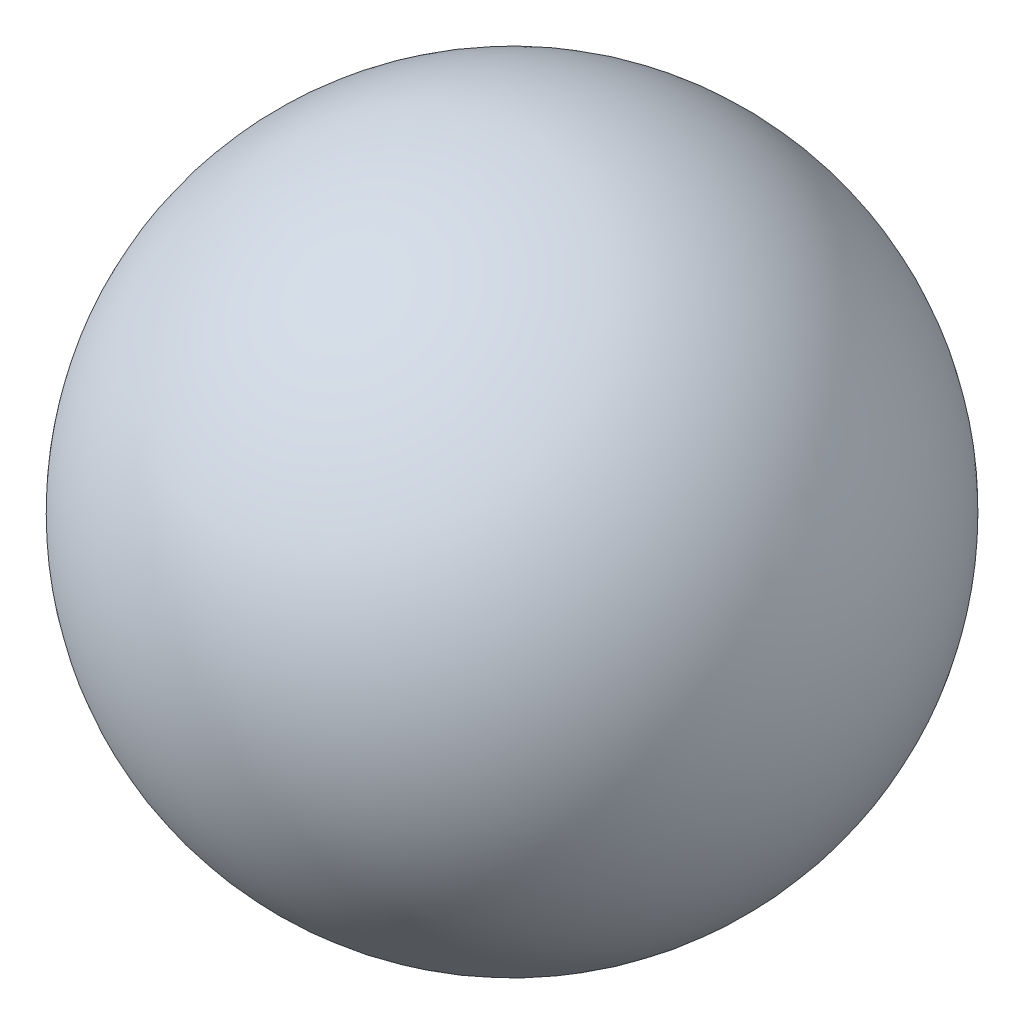
ISO-10303-21;
HEADER;
FILE_DESCRIPTION(('STEP AP214'),'2;1');
FILE_NAME('part.step','',(''),(''),'','','');
FILE_SCHEMA(('AUTOMOTIVE_DESIGN { 1 0 10303 214 1 1 1 1 }'));
ENDSEC;
DATA;
#1=APPLICATION_CONTEXT('core data for automotive mechanical design processes');
#2=APPLICATION_PROTOCOL_DEFINITION('international standard','automotive_design',2000,#1);
#3=PRODUCT_CONTEXT('',#1,'mechanical');
#4=PRODUCT('Part','Part','',(#3));
#5=PRODUCT_RELATED_PRODUCT_CATEGORY('part','',(#4));
#6=PRODUCT_DEFINITION_FORMATION('','',#4);
#7=PRODUCT_DEFINITION_CONTEXT('part definition',#1,'design');
#8=PRODUCT_DEFINITION('design','',#6,#7);
#9=PRODUCT_DEFINITION_SHAPE('','',#8);
#10=(LENGTH_UNIT() NAMED_UNIT(*) SI_UNIT(.MILLI.,.METRE.));
#11=(NAMED_UNIT(*) PLANE_ANGLE_UNIT() SI_UNIT($,.RADIAN.));
#12=(NAMED_UNIT(*) SI_UNIT($,.STERADIAN.) SOLID_ANGLE_UNIT());
#13=UNCERTAINTY_MEASURE_WITH_UNIT(LENGTH_MEASURE(1.E-05),#10,'distance_accuracy_value','');
#14=(GEOMETRIC_REPRESENTATION_CONTEXT(3) GLOBAL_UNCERTAINTY_ASSIGNED_CONTEXT((#13)) GLOBAL_UNIT_ASSIGNED_CONTEXT((#10,
#11,#12)) REPRESENTATION_CONTEXT('',''));
#15=CARTESIAN_POINT('',(0.,0.,0.));
#16=DIRECTION('',(0.,0.,1.));
#17=DIRECTION('',(1.,0.,0.));
#18=AXIS2_PLACEMENT_3D('',#15,#16,#17);
#19=CARTESIAN_POINT('',(2.05212085995394,-5.63815572471615,2.));
#20=DIRECTION('',(-0.939692620785913,-0.342020143325657,0.));
#21=DIRECTION('',(0.,0.,-1.));
#22=AXIS2_PLACEMENT_3D('',#19,#20,#21);
#23=SPHERICAL_SURFACE('',#22,1.04);
#24=CARTESIAN_POINT('',(3.02940118557128,-5.28245477565747,2.));
#25=VERTEX_POINT('',#24);
#26=VERTEX_LOOP('',#25);
#27=FACE_BOUND('',#26,.T.);
#28=ADVANCED_FACE('F15',(#27),#23,.T.);
#29=CLOSED_SHELL('',(#28));
#30=MANIFOLD_SOLID_BREP('B1',#29);
#31=ADVANCED_BREP_SHAPE_REPRESENTATION('',(#18,#30),#14);
#32=SHAPE_DEFINITION_REPRESENTATION(#9,#31);
ENDSEC;
END-ISO-10303-21;
